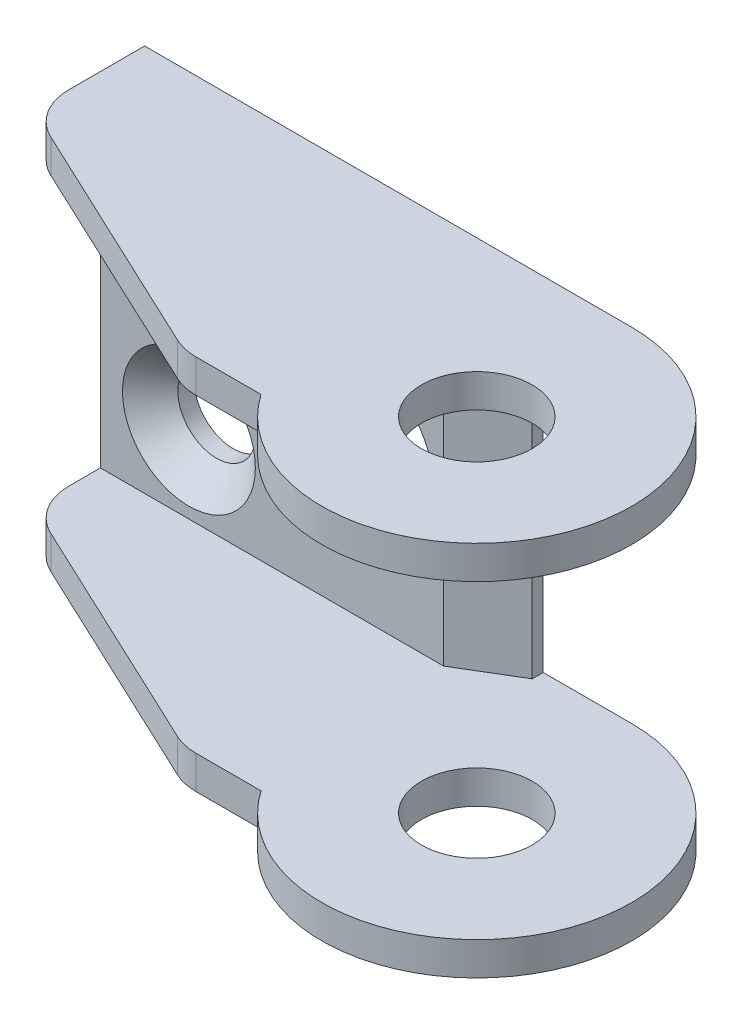
ISO-10303-21;
HEADER;
FILE_DESCRIPTION(('STEP AP214'),'2;1');
FILE_NAME('part.step','',(''),(''),'','','');
FILE_SCHEMA(('AUTOMOTIVE_DESIGN { 1 0 10303 214 1 1 1 1 }'));
ENDSEC;
DATA;
#1=APPLICATION_CONTEXT('core data for automotive mechanical design processes');
#2=APPLICATION_PROTOCOL_DEFINITION('international standard','automotive_design',2000,#1);
#3=PRODUCT_CONTEXT('',#1,'mechanical');
#4=PRODUCT('Part','Part','',(#3));
#5=PRODUCT_RELATED_PRODUCT_CATEGORY('part','',(#4));
#6=PRODUCT_DEFINITION_FORMATION('','',#4);
#7=PRODUCT_DEFINITION_CONTEXT('part definition',#1,'design');
#8=PRODUCT_DEFINITION('design','',#6,#7);
#9=PRODUCT_DEFINITION_SHAPE('','',#8);
#10=(LENGTH_UNIT() NAMED_UNIT(*) SI_UNIT(.MILLI.,.METRE.));
#11=(NAMED_UNIT(*) PLANE_ANGLE_UNIT() SI_UNIT($,.RADIAN.));
#12=(NAMED_UNIT(*) SI_UNIT($,.STERADIAN.) SOLID_ANGLE_UNIT());
#13=UNCERTAINTY_MEASURE_WITH_UNIT(LENGTH_MEASURE(1.E-05),#10,'distance_accuracy_value','');
#14=(GEOMETRIC_REPRESENTATION_CONTEXT(3) GLOBAL_UNCERTAINTY_ASSIGNED_CONTEXT((#13)) GLOBAL_UNIT_ASSIGNED_CONTEXT((#10,
#11,#12)) REPRESENTATION_CONTEXT('',''));
#15=CARTESIAN_POINT('',(0.,0.,0.));
#16=DIRECTION('',(0.,0.,1.));
#17=DIRECTION('',(1.,0.,0.));
#18=AXIS2_PLACEMENT_3D('',#15,#16,#17);
#19=CARTESIAN_POINT('',(-19.5,17.,-3.58680185867504));
#20=DIRECTION('',(0.,1.,0.));
#21=DIRECTION('',(0.,0.,1.));
#22=AXIS2_PLACEMENT_3D('',#19,#20,#21);
#23=CYLINDRICAL_SURFACE('',#22,2.49999999999998);
#24=CARTESIAN_POINT('',(-19.5,15.5,-3.58680185867504));
#25=DIRECTION('',(0.,1.,0.));
#26=DIRECTION('',(0.,0.,1.));
#27=AXIS2_PLACEMENT_3D('',#24,#25,#26);
#28=CIRCLE('',#27,2.49999999999998);
#29=CARTESIAN_POINT('',(-22.,15.5,-3.58680185867504));
#30=VERTEX_POINT('',#29);
#31=CARTESIAN_POINT('',(-20.5641210484647,15.5,-1.32458029697639));
#32=VERTEX_POINT('',#31);
#33=EDGE_CURVE('E252',#30,#32,#28,.T.);
#34=ORIENTED_EDGE('',*,*,#33,.T.);
#35=DIRECTION('',(0.,1.,0.));
#36=VECTOR('',#35,1.);
#37=CARTESIAN_POINT('',(-20.5641210484647,17.,-1.32458029697639));
#38=LINE('',#37,#36);
#39=CARTESIAN_POINT('',(-20.5641210484647,17.,-1.32458029697639));
#40=VERTEX_POINT('',#39);
#41=EDGE_CURVE('E210',#32,#40,#38,.T.);
#42=ORIENTED_EDGE('',*,*,#41,.T.);
#43=CARTESIAN_POINT('',(-19.5,17.,-3.58680185867504));
#44=DIRECTION('',(0.,1.,0.));
#45=DIRECTION('',(0.,0.,1.));
#46=AXIS2_PLACEMENT_3D('',#43,#44,#45);
#47=CIRCLE('',#46,2.49999999999998);
#48=CARTESIAN_POINT('',(-22.,17.,-3.58680185867504));
#49=VERTEX_POINT('',#48);
#50=EDGE_CURVE('E257',#49,#40,#47,.T.);
#51=ORIENTED_EDGE('',*,*,#50,.F.);
#52=DIRECTION('',(0.,1.,0.));
#53=VECTOR('',#52,1.);
#54=CARTESIAN_POINT('',(-22.,0.,-3.58680185867505));
#55=LINE('',#54,#53);
#56=EDGE_CURVE('E127',#30,#49,#55,.T.);
#57=ORIENTED_EDGE('',*,*,#56,.F.);
#58=EDGE_LOOP('',(#34,#42,#51,#57));
#59=FACE_BOUND('',#58,.T.);
#60=ADVANCED_FACE('F17',(#59),#23,.T.);
#61=CARTESIAN_POINT('',(-20.5641210484647,17.,-1.32458029697639));
#62=DIRECTION('',(0.425648419385887,0.,-0.904888624679466));
#63=DIRECTION('',(-0.904888624679466,0.,-0.425648419385887));
#64=AXIS2_PLACEMENT_3D('',#61,#62,#63);
#65=PLANE('',#64);
#66=ORIENTED_EDGE('',*,*,#41,.F.);
#67=DIRECTION('',(0.904888624679466,0.,0.425648419385888));
#68=VECTOR('',#67,1.);
#69=CARTESIAN_POINT('',(-20.5641210484647,15.5,-1.32458029697639));
#70=LINE('',#69,#68);
#71=CARTESIAN_POINT('',(-9.75005730883081,15.5,3.76222156169866));
#72=VERTEX_POINT('',#71);
#73=EDGE_CURVE('E251',#32,#72,#70,.T.);
#74=ORIENTED_EDGE('',*,*,#73,.T.);
#75=DIRECTION('',(0.,1.,0.));
#76=VECTOR('',#75,1.);
#77=CARTESIAN_POINT('',(-9.75005730883081,17.,3.76222156169865));
#78=LINE('',#77,#76);
#79=CARTESIAN_POINT('',(-9.75005730883081,17.,3.76222156169866));
#80=VERTEX_POINT('',#79);
#81=EDGE_CURVE('E98',#80,#72,#78,.F.);
#82=ORIENTED_EDGE('',*,*,#81,.F.);
#83=DIRECTION('',(0.904888624679466,0.,0.425648419385888));
#84=VECTOR('',#83,1.);
#85=CARTESIAN_POINT('',(-20.5641210484647,17.,-1.32458029697639));
#86=LINE('',#85,#84);
#87=EDGE_CURVE('E126',#40,#80,#86,.T.);
#88=ORIENTED_EDGE('',*,*,#87,.F.);
#89=EDGE_LOOP('',(#66,#74,#82,#88));
#90=FACE_BOUND('',#89,.T.);
#91=ADVANCED_FACE('F331',(#90),#65,.F.);
#92=CARTESIAN_POINT('',(-8.68593626036609,17.,1.5));
#93=DIRECTION('',(0.,1.,0.));
#94=DIRECTION('',(0.,0.,1.));
#95=AXIS2_PLACEMENT_3D('',#92,#93,#94);
#96=CYLINDRICAL_SURFACE('',#95,2.49999999999999);
#97=CARTESIAN_POINT('',(-8.68593626036609,15.5,1.5));
#98=DIRECTION('',(0.,1.,0.));
#99=DIRECTION('',(0.,0.,1.));
#100=AXIS2_PLACEMENT_3D('',#97,#98,#99);
#101=CIRCLE('',#100,2.49999999999999);
#102=CARTESIAN_POINT('',(-8.68593626036609,15.5,3.99999999999999));
#103=VERTEX_POINT('',#102);
#104=EDGE_CURVE('E110',#72,#103,#101,.T.);
#105=ORIENTED_EDGE('',*,*,#104,.T.);
#106=DIRECTION('',(0.,1.,0.));
#107=VECTOR('',#106,1.);
#108=CARTESIAN_POINT('',(-8.6859362603661,17.,3.99999999999999));
#109=LINE('',#108,#107);
#110=CARTESIAN_POINT('',(-8.68593626036609,17.,3.99999999999999));
#111=VERTEX_POINT('',#110);
#112=EDGE_CURVE('E103',#103,#111,#109,.T.);
#113=ORIENTED_EDGE('',*,*,#112,.T.);
#114=CARTESIAN_POINT('',(-8.68593626036609,17.,1.5));
#115=DIRECTION('',(0.,1.,0.));
#116=DIRECTION('',(0.,0.,1.));
#117=AXIS2_PLACEMENT_3D('',#114,#115,#116);
#118=CIRCLE('',#117,2.49999999999999);
#119=EDGE_CURVE('E107',#80,#111,#118,.T.);
#120=ORIENTED_EDGE('',*,*,#119,.F.);
#121=ORIENTED_EDGE('',*,*,#81,.T.);
#122=EDGE_LOOP('',(#105,#113,#120,#121));
#123=FACE_BOUND('',#122,.T.);
#124=ADVANCED_FACE('F105',(#123),#96,.T.);
#125=CARTESIAN_POINT('',(-8.6859362603661,17.,3.99999999999999));
#126=DIRECTION('',(0.,0.,-1.));
#127=DIRECTION('',(-1.,0.,0.));
#128=AXIS2_PLACEMENT_3D('',#125,#126,#127);
#129=PLANE('',#128);
#130=ORIENTED_EDGE('',*,*,#112,.F.);
#131=DIRECTION('',(1.,0.,0.));
#132=VECTOR('',#131,1.);
#133=CARTESIAN_POINT('',(-7.5,15.5,3.99999999999999));
#134=LINE('',#133,#132);
#135=CARTESIAN_POINT('',(-5.74456264653803,15.5,3.99999999999999));
#136=VERTEX_POINT('',#135);
#137=EDGE_CURVE('E249',#103,#136,#134,.T.);
#138=ORIENTED_EDGE('',*,*,#137,.T.);
#139=DIRECTION('',(0.,1.,0.));
#140=VECTOR('',#139,1.);
#141=CARTESIAN_POINT('',(-5.74456264653803,17.,4.));
#142=LINE('',#141,#140);
#143=CARTESIAN_POINT('',(-5.74456264653803,17.,3.99999999999999));
#144=VERTEX_POINT('',#143);
#145=EDGE_CURVE('E113',#144,#136,#142,.F.);
#146=ORIENTED_EDGE('',*,*,#145,.F.);
#147=DIRECTION('',(1.,0.,0.));
#148=VECTOR('',#147,1.);
#149=CARTESIAN_POINT('',(-7.5,17.,3.99999999999999));
#150=LINE('',#149,#148);
#151=EDGE_CURVE('E116',#111,#144,#150,.T.);
#152=ORIENTED_EDGE('',*,*,#151,.F.);
#153=EDGE_LOOP('',(#130,#138,#146,#152));
#154=FACE_BOUND('',#153,.T.);
#155=ADVANCED_FACE('F117',(#154),#129,.F.);
#156=CARTESIAN_POINT('',(0.,17.,0.));
#157=DIRECTION('',(0.,1.,0.));
#158=DIRECTION('',(0.,0.,1.));
#159=AXIS2_PLACEMENT_3D('',#156,#157,#158);
#160=CYLINDRICAL_SURFACE('',#159,7.);
#161=CARTESIAN_POINT('',(0.,15.5,0.));
#162=DIRECTION('',(0.,1.,0.));
#163=DIRECTION('',(0.,0.,1.));
#164=AXIS2_PLACEMENT_3D('',#161,#162,#163);
#165=CIRCLE('',#164,7.);
#166=CARTESIAN_POINT('',(0.,15.5,-7.));
#167=VERTEX_POINT('',#166);
#168=EDGE_CURVE('E199',#136,#167,#165,.T.);
#169=ORIENTED_EDGE('',*,*,#168,.T.);
#170=DIRECTION('',(0.,1.,0.));
#171=VECTOR('',#170,1.);
#172=CARTESIAN_POINT('',(0.,17.,-7.));
#173=LINE('',#172,#171);
#174=CARTESIAN_POINT('',(0.,17.,-7.));
#175=VERTEX_POINT('',#174);
#176=EDGE_CURVE('E192',#167,#175,#173,.T.);
#177=ORIENTED_EDGE('',*,*,#176,.T.);
#178=CARTESIAN_POINT('',(0.,17.,0.));
#179=DIRECTION('',(0.,1.,0.));
#180=DIRECTION('',(0.,0.,1.));
#181=AXIS2_PLACEMENT_3D('',#178,#179,#180);
#182=CIRCLE('',#181,7.);
#183=EDGE_CURVE('E122',#144,#175,#182,.T.);
#184=ORIENTED_EDGE('',*,*,#183,.F.);
#185=ORIENTED_EDGE('',*,*,#145,.T.);
#186=EDGE_LOOP('',(#169,#177,#184,#185));
#187=FACE_BOUND('',#186,.T.);
#188=ADVANCED_FACE('F335',(#187),#160,.T.);
#189=CARTESIAN_POINT('',(0.,17.,0.));
#190=DIRECTION('',(0.,1.,0.));
#191=DIRECTION('',(0.,0.,1.));
#192=AXIS2_PLACEMENT_3D('',#189,#190,#191);
#193=CYLINDRICAL_SURFACE('',#192,2.5);
#194=CARTESIAN_POINT('',(0.,17.,0.));
#195=DIRECTION('',(0.,1.,0.));
#196=DIRECTION('',(0.,0.,1.));
#197=AXIS2_PLACEMENT_3D('',#194,#195,#196);
#198=CIRCLE('',#197,2.5);
#199=CARTESIAN_POINT('',(0.,17.,2.5));
#200=VERTEX_POINT('',#199);
#201=EDGE_CURVE('E255',#200,#200,#198,.F.);
#202=ORIENTED_EDGE('',*,*,#201,.F.);
#203=EDGE_LOOP('',(#202));
#204=FACE_BOUND('',#203,.T.);
#205=CARTESIAN_POINT('',(0.,15.5,0.));
#206=DIRECTION('',(0.,1.,0.));
#207=DIRECTION('',(0.,0.,1.));
#208=AXIS2_PLACEMENT_3D('',#205,#206,#207);
#209=CIRCLE('',#208,2.5);
#210=CARTESIAN_POINT('',(0.,15.5,2.5));
#211=VERTEX_POINT('',#210);
#212=EDGE_CURVE('E204',#211,#211,#209,.F.);
#213=ORIENTED_EDGE('',*,*,#212,.T.);
#214=EDGE_LOOP('',(#213));
#215=FACE_BOUND('',#214,.T.);
#216=ADVANCED_FACE('F602',(#204,#215),#193,.F.);
#217=CARTESIAN_POINT('',(-22.,1.5,-5.00000000000001));
#218=DIRECTION('',(0.,0.,1.));
#219=DIRECTION('',(1.,0.,0.));
#220=AXIS2_PLACEMENT_3D('',#217,#218,#219);
#221=PLANE('',#220);
#222=CARTESIAN_POINT('',(-18.,5.,-5.00000000002455));
#223=DIRECTION('',(0.,0.,1.));
#224=DIRECTION('',(1.,0.,0.));
#225=AXIS2_PLACEMENT_3D('',#222,#223,#224);
#226=CIRCLE('',#225,2.99999999992906);
#227=CARTESIAN_POINT('',(-15.0000000000709,5.,-5.00000000002455));
#228=VERTEX_POINT('',#227);
#229=EDGE_CURVE('E134',#228,#228,#226,.F.);
#230=ORIENTED_EDGE('',*,*,#229,.T.);
#231=EDGE_LOOP('',(#230));
#232=FACE_BOUND('',#231,.T.);
#233=CARTESIAN_POINT('',(-10.,8.5,-5.0000000000432));
#234=DIRECTION('',(0.,0.,1.));
#235=DIRECTION('',(1.,0.,0.));
#236=AXIS2_PLACEMENT_3D('',#233,#234,#235);
#237=CIRCLE('',#236,2.9999999999859);
#238=CARTESIAN_POINT('',(-7.0000000000141,8.5,-5.0000000000432));
#239=VERTEX_POINT('',#238);
#240=EDGE_CURVE('E20',#239,#239,#237,.F.);
#241=ORIENTED_EDGE('',*,*,#240,.T.);
#242=EDGE_LOOP('',(#241));
#243=FACE_BOUND('',#242,.T.);
#244=CARTESIAN_POINT('',(-18.,12.,-5.00000000002455));
#245=DIRECTION('',(0.,0.,1.));
#246=DIRECTION('',(1.,0.,0.));
#247=AXIS2_PLACEMENT_3D('',#244,#245,#246);
#248=CIRCLE('',#247,2.99999999992906);
#249=CARTESIAN_POINT('',(-15.0000000000709,12.,-5.00000000002455));
#250=VERTEX_POINT('',#249);
#251=EDGE_CURVE('E137',#250,#250,#248,.F.);
#252=ORIENTED_EDGE('',*,*,#251,.T.);
#253=EDGE_LOOP('',(#252));
#254=FACE_BOUND('',#253,.T.);
#255=DIRECTION('',(0.,1.,0.));
#256=VECTOR('',#255,1.);
#257=CARTESIAN_POINT('',(-6.5,1.5,-5.00000000000001));
#258=LINE('',#257,#256);
#259=CARTESIAN_POINT('',(-6.5,15.5,-5.00000000000001));
#260=VERTEX_POINT('',#259);
#261=CARTESIAN_POINT('',(-6.5,1.5,-5.00000000000001));
#262=VERTEX_POINT('',#261);
#263=EDGE_CURVE('E166',#260,#262,#258,.F.);
#264=ORIENTED_EDGE('',*,*,#263,.F.);
#265=DIRECTION('',(1.,0.,0.));
#266=VECTOR('',#265,1.);
#267=CARTESIAN_POINT('',(-7.5,15.5,-5.00000000000001));
#268=LINE('',#267,#266);
#269=CARTESIAN_POINT('',(-22.,15.5,-5.00000000000001));
#270=VERTEX_POINT('',#269);
#271=EDGE_CURVE('E198',#260,#270,#268,.F.);
#272=ORIENTED_EDGE('',*,*,#271,.T.);
#273=DIRECTION('',(0.,1.,0.));
#274=VECTOR('',#273,1.);
#275=CARTESIAN_POINT('',(-22.,0.,-5.00000000000001));
#276=LINE('',#275,#274);
#277=CARTESIAN_POINT('',(-22.,1.5,-5.00000000000001));
#278=VERTEX_POINT('',#277);
#279=EDGE_CURVE('E129',#278,#270,#276,.T.);
#280=ORIENTED_EDGE('',*,*,#279,.F.);
#281=DIRECTION('',(1.,0.,0.));
#282=VECTOR('',#281,1.);
#283=CARTESIAN_POINT('',(-7.5,1.5,-5.00000000000001));
#284=LINE('',#283,#282);
#285=EDGE_CURVE('E170',#262,#278,#284,.F.);
#286=ORIENTED_EDGE('',*,*,#285,.F.);
#287=EDGE_LOOP('',(#264,#272,#280,#286));
#288=FACE_BOUND('',#287,.T.);
#289=ADVANCED_FACE('F386',(#232,#243,#254,#288),#221,.T.);
#290=CARTESIAN_POINT('',(-6.5,1.5,-5.00000000000001));
#291=DIRECTION('',(0.514495755427527,0.,0.857492925712544));
#292=DIRECTION('',(0.857492925712544,0.,-0.514495755427527));
#293=AXIS2_PLACEMENT_3D('',#290,#291,#292);
#294=PLANE('',#293);
#295=DIRECTION('',(-0.857492925712544,0.,0.514495755427527));
#296=VECTOR('',#295,1.);
#297=CARTESIAN_POINT('',(-4.,15.5,-6.50000000000001));
#298=LINE('',#297,#296);
#299=CARTESIAN_POINT('',(-4.,15.5,-6.50000000000001));
#300=VERTEX_POINT('',#299);
#301=EDGE_CURVE('E195',#300,#260,#298,.T.);
#302=ORIENTED_EDGE('',*,*,#301,.T.);
#303=ORIENTED_EDGE('',*,*,#263,.T.);
#304=DIRECTION('',(-0.857492925712544,0.,0.514495755427527));
#305=VECTOR('',#304,1.);
#306=CARTESIAN_POINT('',(-4.,1.5,-6.50000000000001));
#307=LINE('',#306,#305);
#308=CARTESIAN_POINT('',(-4.,1.5,-6.50000000000001));
#309=VERTEX_POINT('',#308);
#310=EDGE_CURVE('E174',#309,#262,#307,.T.);
#311=ORIENTED_EDGE('',*,*,#310,.F.);
#312=DIRECTION('',(0.,1.,0.));
#313=VECTOR('',#312,1.);
#314=CARTESIAN_POINT('',(-4.,1.5,-6.50000000000001));
#315=LINE('',#314,#313);
#316=EDGE_CURVE('E167',#300,#309,#315,.F.);
#317=ORIENTED_EDGE('',*,*,#316,.F.);
#318=EDGE_LOOP('',(#302,#303,#311,#317));
#319=FACE_BOUND('',#318,.T.);
#320=ADVANCED_FACE('F388',(#319),#294,.T.);
#321=CARTESIAN_POINT('',(-8.6859362603661,0.,3.99999999999999));
#322=DIRECTION('',(0.,0.,1.));
#323=DIRECTION('',(1.,0.,0.));
#324=AXIS2_PLACEMENT_3D('',#321,#322,#323);
#325=PLANE('',#324);
#326=DIRECTION('',(1.,0.,0.));
#327=VECTOR('',#326,1.);
#328=CARTESIAN_POINT('',(-7.5,1.5,3.99999999999999));
#329=LINE('',#328,#327);
#330=CARTESIAN_POINT('',(-8.68593626036609,1.5,3.99999999999999));
#331=VERTEX_POINT('',#330);
#332=CARTESIAN_POINT('',(-5.74456264653803,1.5,3.99999999999999));
#333=VERTEX_POINT('',#332);
#334=EDGE_CURVE('E237',#331,#333,#329,.T.);
#335=ORIENTED_EDGE('',*,*,#334,.F.);
#336=DIRECTION('',(0.,1.,0.));
#337=VECTOR('',#336,1.);
#338=CARTESIAN_POINT('',(-8.68593626036609,0.,3.99999999999999));
#339=LINE('',#338,#337);
#340=CARTESIAN_POINT('',(-8.68593626036609,0.,3.99999999999999));
#341=VERTEX_POINT('',#340);
#342=EDGE_CURVE('E146',#341,#331,#339,.T.);
#343=ORIENTED_EDGE('',*,*,#342,.F.);
#344=DIRECTION('',(1.,0.,0.));
#345=VECTOR('',#344,1.);
#346=CARTESIAN_POINT('',(-7.5,0.,3.99999999999999));
#347=LINE('',#346,#345);
#348=CARTESIAN_POINT('',(-5.74456264653803,0.,3.99999999999999));
#349=VERTEX_POINT('',#348);
#350=EDGE_CURVE('E231',#341,#349,#347,.T.);
#351=ORIENTED_EDGE('',*,*,#350,.T.);
#352=DIRECTION('',(0.,1.,0.));
#353=VECTOR('',#352,1.);
#354=CARTESIAN_POINT('',(-5.74456264653803,0.,4.));
#355=LINE('',#354,#353);
#356=EDGE_CURVE('E161',#333,#349,#355,.F.);
#357=ORIENTED_EDGE('',*,*,#356,.F.);
#358=EDGE_LOOP('',(#335,#343,#351,#357));
#359=FACE_BOUND('',#358,.T.);
#360=ADVANCED_FACE('F403',(#359),#325,.T.);
#361=CARTESIAN_POINT('',(0.,0.,0.));
#362=DIRECTION('',(0.,1.,0.));
#363=DIRECTION('',(0.,0.,1.));
#364=AXIS2_PLACEMENT_3D('',#361,#362,#363);
#365=CYLINDRICAL_SURFACE('',#364,7.);
#366=CARTESIAN_POINT('',(0.,1.5,0.));
#367=DIRECTION('',(0.,1.,0.));
#368=DIRECTION('',(0.,0.,1.));
#369=AXIS2_PLACEMENT_3D('',#366,#367,#368);
#370=CIRCLE('',#369,7.);
#371=CARTESIAN_POINT('',(0.,1.5,-7.));
#372=VERTEX_POINT('',#371);
#373=EDGE_CURVE('E234',#333,#372,#370,.T.);
#374=ORIENTED_EDGE('',*,*,#373,.F.);
#375=ORIENTED_EDGE('',*,*,#356,.T.);
#376=CARTESIAN_POINT('',(0.,0.,0.));
#377=DIRECTION('',(0.,1.,0.));
#378=DIRECTION('',(0.,0.,1.));
#379=AXIS2_PLACEMENT_3D('',#376,#377,#378);
#380=CIRCLE('',#379,7.);
#381=CARTESIAN_POINT('',(0.,0.,-7.));
#382=VERTEX_POINT('',#381);
#383=EDGE_CURVE('E229',#349,#382,#380,.T.);
#384=ORIENTED_EDGE('',*,*,#383,.T.);
#385=DIRECTION('',(0.,1.,0.));
#386=VECTOR('',#385,1.);
#387=CARTESIAN_POINT('',(0.,0.,-7.));
#388=LINE('',#387,#386);
#389=EDGE_CURVE('E35',#382,#372,#388,.T.);
#390=ORIENTED_EDGE('',*,*,#389,.T.);
#391=EDGE_LOOP('',(#374,#375,#384,#390));
#392=FACE_BOUND('',#391,.T.);
#393=ADVANCED_FACE('F401',(#392),#365,.T.);
#394=CARTESIAN_POINT('',(-19.5,0.,-3.58680185867504));
#395=DIRECTION('',(0.,1.,0.));
#396=DIRECTION('',(0.,0.,1.));
#397=AXIS2_PLACEMENT_3D('',#394,#395,#396);
#398=CYLINDRICAL_SURFACE('',#397,2.49999999999998);
#399=CARTESIAN_POINT('',(-19.5,1.5,-3.58680185867504));
#400=DIRECTION('',(0.,1.,0.));
#401=DIRECTION('',(0.,0.,1.));
#402=AXIS2_PLACEMENT_3D('',#399,#400,#401);
#403=CIRCLE('',#402,2.49999999999998);
#404=CARTESIAN_POINT('',(-22.,1.5,-3.58680185867504));
#405=VERTEX_POINT('',#404);
#406=CARTESIAN_POINT('',(-20.5641210484647,1.5,-1.32458029697639));
#407=VERTEX_POINT('',#406);
#408=EDGE_CURVE('E242',#405,#407,#403,.T.);
#409=ORIENTED_EDGE('',*,*,#408,.F.);
#410=DIRECTION('',(0.,1.,0.));
#411=VECTOR('',#410,1.);
#412=CARTESIAN_POINT('',(-22.,0.,-3.58680185867505));
#413=LINE('',#412,#411);
#414=CARTESIAN_POINT('',(-22.,0.,-3.58680185867504));
#415=VERTEX_POINT('',#414);
#416=EDGE_CURVE('E136',#415,#405,#413,.T.);
#417=ORIENTED_EDGE('',*,*,#416,.F.);
#418=CARTESIAN_POINT('',(-19.5,0.,-3.58680185867504));
#419=DIRECTION('',(0.,1.,0.));
#420=DIRECTION('',(0.,0.,1.));
#421=AXIS2_PLACEMENT_3D('',#418,#419,#420);
#422=CIRCLE('',#421,2.49999999999998);
#423=CARTESIAN_POINT('',(-20.5641210484647,0.,-1.32458029697639));
#424=VERTEX_POINT('',#423);
#425=EDGE_CURVE('E225',#415,#424,#422,.T.);
#426=ORIENTED_EDGE('',*,*,#425,.T.);
#427=DIRECTION('',(0.,1.,0.));
#428=VECTOR('',#427,1.);
#429=CARTESIAN_POINT('',(-20.5641210484647,0.,-1.32458029697639));
#430=LINE('',#429,#428);
#431=EDGE_CURVE('E153',#407,#424,#430,.F.);
#432=ORIENTED_EDGE('',*,*,#431,.F.);
#433=EDGE_LOOP('',(#409,#417,#426,#432));
#434=FACE_BOUND('',#433,.T.);
#435=ADVANCED_FACE('F361',(#434),#398,.T.);
#436=CARTESIAN_POINT('',(-20.5641210484647,0.,-1.32458029697639));
#437=DIRECTION('',(-0.425648419385887,0.,0.904888624679466));
#438=DIRECTION('',(0.904888624679466,0.,0.425648419385887));
#439=AXIS2_PLACEMENT_3D('',#436,#437,#438);
#440=PLANE('',#439);
#441=DIRECTION('',(0.904888624679466,0.,0.425648419385888));
#442=VECTOR('',#441,1.);
#443=CARTESIAN_POINT('',(-20.5641210484647,1.5,-1.32458029697639));
#444=LINE('',#443,#442);
#445=CARTESIAN_POINT('',(-9.75005730883081,1.5,3.76222156169866));
#446=VERTEX_POINT('',#445);
#447=EDGE_CURVE('E241',#407,#446,#444,.T.);
#448=ORIENTED_EDGE('',*,*,#447,.F.);
#449=ORIENTED_EDGE('',*,*,#431,.T.);
#450=DIRECTION('',(0.904888624679466,0.,0.425648419385888));
#451=VECTOR('',#450,1.);
#452=CARTESIAN_POINT('',(-20.5641210484647,0.,-1.32458029697639));
#453=LINE('',#452,#451);
#454=CARTESIAN_POINT('',(-9.75005730883081,0.,3.76222156169866));
#455=VERTEX_POINT('',#454);
#456=EDGE_CURVE('E224',#424,#455,#453,.T.);
#457=ORIENTED_EDGE('',*,*,#456,.T.);
#458=DIRECTION('',(0.,1.,0.));
#459=VECTOR('',#458,1.);
#460=CARTESIAN_POINT('',(-9.75005730883081,0.,3.76222156169865));
#461=LINE('',#460,#459);
#462=EDGE_CURVE('E142',#446,#455,#461,.F.);
#463=ORIENTED_EDGE('',*,*,#462,.F.);
#464=EDGE_LOOP('',(#448,#449,#457,#463));
#465=FACE_BOUND('',#464,.T.);
#466=ADVANCED_FACE('F368',(#465),#440,.T.);
#467=CARTESIAN_POINT('',(-8.68593626036609,0.,1.5));
#468=DIRECTION('',(0.,1.,0.));
#469=DIRECTION('',(0.,0.,1.));
#470=AXIS2_PLACEMENT_3D('',#467,#468,#469);
#471=CYLINDRICAL_SURFACE('',#470,2.49999999999999);
#472=CARTESIAN_POINT('',(-8.68593626036609,1.5,1.5));
#473=DIRECTION('',(0.,1.,0.));
#474=DIRECTION('',(0.,0.,1.));
#475=AXIS2_PLACEMENT_3D('',#472,#473,#474);
#476=CIRCLE('',#475,2.49999999999999);
#477=EDGE_CURVE('E238',#446,#331,#476,.T.);
#478=ORIENTED_EDGE('',*,*,#477,.F.);
#479=ORIENTED_EDGE('',*,*,#462,.T.);
#480=CARTESIAN_POINT('',(-8.68593626036609,0.,1.5));
#481=DIRECTION('',(0.,1.,0.));
#482=DIRECTION('',(0.,0.,1.));
#483=AXIS2_PLACEMENT_3D('',#480,#481,#482);
#484=CIRCLE('',#483,2.49999999999999);
#485=EDGE_CURVE('E222',#455,#341,#484,.T.);
#486=ORIENTED_EDGE('',*,*,#485,.T.);
#487=ORIENTED_EDGE('',*,*,#342,.T.);
#488=EDGE_LOOP('',(#478,#479,#486,#487));
#489=FACE_BOUND('',#488,.T.);
#490=ADVANCED_FACE('F404',(#489),#471,.T.);
#491=CARTESIAN_POINT('',(0.,0.,0.));
#492=DIRECTION('',(0.,1.,0.));
#493=DIRECTION('',(0.,0.,1.));
#494=AXIS2_PLACEMENT_3D('',#491,#492,#493);
#495=CYLINDRICAL_SURFACE('',#494,2.5);
#496=CARTESIAN_POINT('',(0.,0.,0.));
#497=DIRECTION('',(0.,1.,0.));
#498=DIRECTION('',(0.,0.,1.));
#499=AXIS2_PLACEMENT_3D('',#496,#497,#498);
#500=CIRCLE('',#499,2.5);
#501=CARTESIAN_POINT('',(0.,0.,2.5));
#502=VERTEX_POINT('',#501);
#503=EDGE_CURVE('E218',#502,#502,#500,.F.);
#504=ORIENTED_EDGE('',*,*,#503,.T.);
#505=EDGE_LOOP('',(#504));
#506=FACE_BOUND('',#505,.T.);
#507=CARTESIAN_POINT('',(0.,1.5,0.));
#508=DIRECTION('',(0.,1.,0.));
#509=DIRECTION('',(0.,0.,1.));
#510=AXIS2_PLACEMENT_3D('',#507,#508,#509);
#511=CIRCLE('',#510,2.5);
#512=CARTESIAN_POINT('',(0.,1.5,2.5));
#513=VERTEX_POINT('',#512);
#514=EDGE_CURVE('E177',#513,#513,#511,.F.);
#515=ORIENTED_EDGE('',*,*,#514,.F.);
#516=EDGE_LOOP('',(#515));
#517=FACE_BOUND('',#516,.T.);
#518=ADVANCED_FACE('F406',(#506,#517),#495,.F.);
#519=CARTESIAN_POINT('',(-10.,8.5,-5.00000000010914));
#520=DIRECTION('',(0.,0.,1.));
#521=DIRECTION('',(1.,0.,0.));
#522=AXIS2_PLACEMENT_3D('',#519,#520,#521);
#523=CONICAL_SURFACE('',#522,2.99999999991996,0.785398163420186);
#524=CARTESIAN_POINT('',(-10.,8.5,-6.25000000000001));
#525=DIRECTION('',(0.,0.,-1.));
#526=DIRECTION('',(-1.,0.,0.));
#527=AXIS2_PLACEMENT_3D('',#524,#525,#526);
#528=CIRCLE('',#527,1.75);
#529=CARTESIAN_POINT('',(-11.75,8.5,-6.25000000000001));
#530=VERTEX_POINT('',#529);
#531=EDGE_CURVE('E221',#530,#530,#528,.T.);
#532=ORIENTED_EDGE('',*,*,#531,.T.);
#533=EDGE_LOOP('',(#532));
#534=FACE_BOUND('',#533,.T.);
#535=ORIENTED_EDGE('',*,*,#240,.F.);
#536=EDGE_LOOP('',(#535));
#537=FACE_BOUND('',#536,.T.);
#538=ADVANCED_FACE('F413',(#534,#537),#523,.F.);
#539=CARTESIAN_POINT('',(-18.,12.,-4.99999999999545));
#540=DIRECTION('',(0.,0.,1.));
#541=DIRECTION('',(1.,0.,0.));
#542=AXIS2_PLACEMENT_3D('',#539,#540,#541);
#543=CONICAL_SURFACE('',#542,2.99999999995816,0.785398163397448);
#544=CARTESIAN_POINT('',(-18.,12.,-6.25000000000001));
#545=DIRECTION('',(0.,0.,1.));
#546=DIRECTION('',(1.,0.,0.));
#547=AXIS2_PLACEMENT_3D('',#544,#545,#546);
#548=CIRCLE('',#547,1.75);
#549=CARTESIAN_POINT('',(-16.25,12.,-6.25000000000001));
#550=VERTEX_POINT('',#549);
#551=EDGE_CURVE('E280',#550,#550,#548,.F.);
#552=ORIENTED_EDGE('',*,*,#551,.T.);
#553=EDGE_LOOP('',(#552));
#554=FACE_BOUND('',#553,.T.);
#555=ORIENTED_EDGE('',*,*,#251,.F.);
#556=EDGE_LOOP('',(#555));
#557=FACE_BOUND('',#556,.T.);
#558=ADVANCED_FACE('F455',(#554,#557),#543,.F.);
#559=CARTESIAN_POINT('',(-18.,5.,-4.99999999999545));
#560=DIRECTION('',(0.,0.,1.));
#561=DIRECTION('',(1.,0.,0.));
#562=AXIS2_PLACEMENT_3D('',#559,#560,#561);
#563=CONICAL_SURFACE('',#562,2.99999999995816,0.785398163397448);
#564=CARTESIAN_POINT('',(-18.,5.,-6.25000000000001));
#565=DIRECTION('',(0.,0.,-1.));
#566=DIRECTION('',(-1.,0.,0.));
#567=AXIS2_PLACEMENT_3D('',#564,#565,#566);
#568=CIRCLE('',#567,1.75);
#569=CARTESIAN_POINT('',(-19.75,5.,-6.25000000000001));
#570=VERTEX_POINT('',#569);
#571=EDGE_CURVE('E276',#570,#570,#568,.T.);
#572=ORIENTED_EDGE('',*,*,#571,.T.);
#573=EDGE_LOOP('',(#572));
#574=FACE_BOUND('',#573,.T.);
#575=ORIENTED_EDGE('',*,*,#229,.F.);
#576=EDGE_LOOP('',(#575));
#577=FACE_BOUND('',#576,.T.);
#578=ADVANCED_FACE('F452',(#574,#577),#563,.F.);
#579=CARTESIAN_POINT('',(-22.,0.,-7.00000000000001));
#580=DIRECTION('',(-1.,0.,0.));
#581=DIRECTION('',(0.,0.,1.));
#582=AXIS2_PLACEMENT_3D('',#579,#580,#581);
#583=PLANE('',#582);
#584=DIRECTION('',(0.,0.,1.));
#585=VECTOR('',#584,1.);
#586=CARTESIAN_POINT('',(-22.,17.,0.));
#587=LINE('',#586,#585);
#588=CARTESIAN_POINT('',(-22.,17.,-7.00000000000001));
#589=VERTEX_POINT('',#588);
#590=EDGE_CURVE('E258',#589,#49,#587,.T.);
#591=ORIENTED_EDGE('',*,*,#590,.F.);
#592=DIRECTION('',(0.,1.,0.));
#593=VECTOR('',#592,1.);
#594=CARTESIAN_POINT('',(-22.,0.,-7.00000000000001));
#595=LINE('',#594,#593);
#596=CARTESIAN_POINT('',(-22.,0.,-7.00000000000001));
#597=VERTEX_POINT('',#596);
#598=EDGE_CURVE('E271',#597,#589,#595,.T.);
#599=ORIENTED_EDGE('',*,*,#598,.F.);
#600=DIRECTION('',(0.,0.,1.));
#601=VECTOR('',#600,1.);
#602=CARTESIAN_POINT('',(-22.,0.,0.));
#603=LINE('',#602,#601);
#604=EDGE_CURVE('E228',#597,#415,#603,.T.);
#605=ORIENTED_EDGE('',*,*,#604,.T.);
#606=ORIENTED_EDGE('',*,*,#416,.T.);
#607=DIRECTION('',(0.,0.,1.));
#608=VECTOR('',#607,1.);
#609=CARTESIAN_POINT('',(-22.,1.5,0.));
#610=LINE('',#609,#608);
#611=EDGE_CURVE('E187',#278,#405,#610,.T.);
#612=ORIENTED_EDGE('',*,*,#611,.F.);
#613=ORIENTED_EDGE('',*,*,#279,.T.);
#614=DIRECTION('',(0.,0.,1.));
#615=VECTOR('',#614,1.);
#616=CARTESIAN_POINT('',(-22.,15.5,0.));
#617=LINE('',#616,#615);
#618=EDGE_CURVE('E254',#270,#30,#617,.T.);
#619=ORIENTED_EDGE('',*,*,#618,.T.);
#620=ORIENTED_EDGE('',*,*,#56,.T.);
#621=EDGE_LOOP('',(#591,#599,#605,#606,#612,#613,#619,#620));
#622=FACE_BOUND('',#621,.T.);
#623=ADVANCED_FACE('F321',(#622),#583,.T.);
#624=CARTESIAN_POINT('',(-7.5,17.,0.));
#625=DIRECTION('',(0.,1.,0.));
#626=DIRECTION('',(0.,0.,1.));
#627=AXIS2_PLACEMENT_3D('',#624,#625,#626);
#628=PLANE('',#627);
#629=ORIENTED_EDGE('',*,*,#201,.T.);
#630=EDGE_LOOP('',(#629));
#631=FACE_BOUND('',#630,.T.);
#632=ORIENTED_EDGE('',*,*,#50,.T.);
#633=ORIENTED_EDGE('',*,*,#87,.T.);
#634=ORIENTED_EDGE('',*,*,#119,.T.);
#635=ORIENTED_EDGE('',*,*,#151,.T.);
#636=ORIENTED_EDGE('',*,*,#183,.T.);
#637=DIRECTION('',(-1.,0.,0.));
#638=VECTOR('',#637,1.);
#639=CARTESIAN_POINT('',(0.,17.,-7.));
#640=LINE('',#639,#638);
#641=EDGE_CURVE('E268',#589,#175,#640,.F.);
#642=ORIENTED_EDGE('',*,*,#641,.F.);
#643=ORIENTED_EDGE('',*,*,#590,.T.);
#644=EDGE_LOOP('',(#632,#633,#634,#635,#636,#642,#643));
#645=FACE_BOUND('',#644,.T.);
#646=ADVANCED_FACE('F125',(#631,#645),#628,.T.);
#647=CARTESIAN_POINT('',(-7.5,15.5,0.));
#648=DIRECTION('',(0.,1.,0.));
#649=DIRECTION('',(0.,0.,1.));
#650=AXIS2_PLACEMENT_3D('',#647,#648,#649);
#651=PLANE('',#650);
#652=ORIENTED_EDGE('',*,*,#212,.F.);
#653=EDGE_LOOP('',(#652));
#654=FACE_BOUND('',#653,.T.);
#655=ORIENTED_EDGE('',*,*,#301,.F.);
#656=DIRECTION('',(0.,0.,-1.));
#657=VECTOR('',#656,1.);
#658=CARTESIAN_POINT('',(-4.,15.5,-6.50000000000001));
#659=LINE('',#658,#657);
#660=CARTESIAN_POINT('',(-4.,15.5,-7.));
#661=VERTEX_POINT('',#660);
#662=EDGE_CURVE('E171',#661,#300,#659,.F.);
#663=ORIENTED_EDGE('',*,*,#662,.F.);
#664=DIRECTION('',(-1.,0.,0.));
#665=VECTOR('',#664,1.);
#666=CARTESIAN_POINT('',(0.,15.5,-7.));
#667=LINE('',#666,#665);
#668=EDGE_CURVE('E270',#167,#661,#667,.T.);
#669=ORIENTED_EDGE('',*,*,#668,.F.);
#670=ORIENTED_EDGE('',*,*,#168,.F.);
#671=ORIENTED_EDGE('',*,*,#137,.F.);
#672=ORIENTED_EDGE('',*,*,#104,.F.);
#673=ORIENTED_EDGE('',*,*,#73,.F.);
#674=ORIENTED_EDGE('',*,*,#33,.F.);
#675=ORIENTED_EDGE('',*,*,#618,.F.);
#676=ORIENTED_EDGE('',*,*,#271,.F.);
#677=EDGE_LOOP('',(#655,#663,#669,#670,#671,#672,#673,#674,#675,#676));
#678=FACE_BOUND('',#677,.T.);
#679=ADVANCED_FACE('F328',(#654,#678),#651,.F.);
#680=CARTESIAN_POINT('',(-4.,1.5,-6.50000000000001));
#681=DIRECTION('',(1.,0.,0.));
#682=DIRECTION('',(0.,0.,-1.));
#683=AXIS2_PLACEMENT_3D('',#680,#681,#682);
#684=PLANE('',#683);
#685=ORIENTED_EDGE('',*,*,#662,.T.);
#686=ORIENTED_EDGE('',*,*,#316,.T.);
#687=DIRECTION('',(0.,0.,1.));
#688=VECTOR('',#687,1.);
#689=CARTESIAN_POINT('',(-4.,1.5,0.));
#690=LINE('',#689,#688);
#691=CARTESIAN_POINT('',(-4.,1.5,-7.));
#692=VERTEX_POINT('',#691);
#693=EDGE_CURVE('E178',#692,#309,#690,.T.);
#694=ORIENTED_EDGE('',*,*,#693,.F.);
#695=DIRECTION('',(0.,1.,0.));
#696=VECTOR('',#695,1.);
#697=CARTESIAN_POINT('',(-4.,0.,-7.));
#698=LINE('',#697,#696);
#699=EDGE_CURVE('E274',#661,#692,#698,.F.);
#700=ORIENTED_EDGE('',*,*,#699,.F.);
#701=EDGE_LOOP('',(#685,#686,#694,#700));
#702=FACE_BOUND('',#701,.T.);
#703=ADVANCED_FACE('F394',(#702),#684,.T.);
#704=CARTESIAN_POINT('',(-7.5,1.5,0.));
#705=DIRECTION('',(0.,1.,0.));
#706=DIRECTION('',(0.,0.,1.));
#707=AXIS2_PLACEMENT_3D('',#704,#705,#706);
#708=PLANE('',#707);
#709=ORIENTED_EDGE('',*,*,#514,.T.);
#710=EDGE_LOOP('',(#709));
#711=FACE_BOUND('',#710,.T.);
#712=ORIENTED_EDGE('',*,*,#693,.T.);
#713=ORIENTED_EDGE('',*,*,#310,.T.);
#714=ORIENTED_EDGE('',*,*,#285,.T.);
#715=ORIENTED_EDGE('',*,*,#611,.T.);
#716=ORIENTED_EDGE('',*,*,#408,.T.);
#717=ORIENTED_EDGE('',*,*,#447,.T.);
#718=ORIENTED_EDGE('',*,*,#477,.T.);
#719=ORIENTED_EDGE('',*,*,#334,.T.);
#720=ORIENTED_EDGE('',*,*,#373,.T.);
#721=DIRECTION('',(-1.,0.,0.));
#722=VECTOR('',#721,1.);
#723=CARTESIAN_POINT('',(0.,1.5,-7.));
#724=LINE('',#723,#722);
#725=EDGE_CURVE('E296',#692,#372,#724,.F.);
#726=ORIENTED_EDGE('',*,*,#725,.F.);
#727=EDGE_LOOP('',(#712,#713,#714,#715,#716,#717,#718,#719,#720,#726));
#728=FACE_BOUND('',#727,.T.);
#729=ADVANCED_FACE('F383',(#711,#728),#708,.T.);
#730=CARTESIAN_POINT('',(-7.5,0.,0.));
#731=DIRECTION('',(0.,1.,0.));
#732=DIRECTION('',(0.,0.,1.));
#733=AXIS2_PLACEMENT_3D('',#730,#731,#732);
#734=PLANE('',#733);
#735=ORIENTED_EDGE('',*,*,#503,.F.);
#736=EDGE_LOOP('',(#735));
#737=FACE_BOUND('',#736,.T.);
#738=ORIENTED_EDGE('',*,*,#456,.F.);
#739=ORIENTED_EDGE('',*,*,#425,.F.);
#740=ORIENTED_EDGE('',*,*,#604,.F.);
#741=DIRECTION('',(-1.,0.,0.));
#742=VECTOR('',#741,1.);
#743=CARTESIAN_POINT('',(0.,0.,-7.));
#744=LINE('',#743,#742);
#745=EDGE_CURVE('E217',#382,#597,#744,.T.);
#746=ORIENTED_EDGE('',*,*,#745,.F.);
#747=ORIENTED_EDGE('',*,*,#383,.F.);
#748=ORIENTED_EDGE('',*,*,#350,.F.);
#749=ORIENTED_EDGE('',*,*,#485,.F.);
#750=EDGE_LOOP('',(#738,#739,#740,#746,#747,#748,#749));
#751=FACE_BOUND('',#750,.T.);
#752=ADVANCED_FACE('F369',(#737,#751),#734,.F.);
#753=CARTESIAN_POINT('',(-10.,8.5,-5.00000000000001));
#754=DIRECTION('',(0.,0.,-1.));
#755=DIRECTION('',(-1.,0.,0.));
#756=AXIS2_PLACEMENT_3D('',#753,#754,#755);
#757=CYLINDRICAL_SURFACE('',#756,1.75);
#758=CARTESIAN_POINT('',(-10.,8.5,-7.));
#759=DIRECTION('',(0.,0.,-1.));
#760=DIRECTION('',(-1.,0.,0.));
#761=AXIS2_PLACEMENT_3D('',#758,#759,#760);
#762=CIRCLE('',#761,1.75);
#763=CARTESIAN_POINT('',(-11.75,8.5,-7.));
#764=VERTEX_POINT('',#763);
#765=EDGE_CURVE('E214',#764,#764,#762,.F.);
#766=ORIENTED_EDGE('',*,*,#765,.F.);
#767=EDGE_LOOP('',(#766));
#768=FACE_BOUND('',#767,.T.);
#769=ORIENTED_EDGE('',*,*,#531,.F.);
#770=EDGE_LOOP('',(#769));
#771=FACE_BOUND('',#770,.T.);
#772=ADVANCED_FACE('F431',(#768,#771),#757,.F.);
#773=CARTESIAN_POINT('',(-18.,12.,-5.00000000000001));
#774=DIRECTION('',(0.,0.,1.));
#775=DIRECTION('',(1.,0.,0.));
#776=AXIS2_PLACEMENT_3D('',#773,#774,#775);
#777=CYLINDRICAL_SURFACE('',#776,1.75);
#778=CARTESIAN_POINT('',(-18.,12.,-7.));
#779=DIRECTION('',(0.,0.,1.));
#780=DIRECTION('',(1.,0.,0.));
#781=AXIS2_PLACEMENT_3D('',#778,#779,#780);
#782=CIRCLE('',#781,1.75);
#783=CARTESIAN_POINT('',(-16.25,12.,-7.));
#784=VERTEX_POINT('',#783);
#785=EDGE_CURVE('E26',#784,#784,#782,.T.);
#786=ORIENTED_EDGE('',*,*,#785,.F.);
#787=EDGE_LOOP('',(#786));
#788=FACE_BOUND('',#787,.T.);
#789=ORIENTED_EDGE('',*,*,#551,.F.);
#790=EDGE_LOOP('',(#789));
#791=FACE_BOUND('',#790,.T.);
#792=ADVANCED_FACE('F424',(#788,#791),#777,.F.);
#793=CARTESIAN_POINT('',(-18.,5.,-5.00000000000001));
#794=DIRECTION('',(0.,0.,-1.));
#795=DIRECTION('',(-1.,0.,0.));
#796=AXIS2_PLACEMENT_3D('',#793,#794,#795);
#797=CYLINDRICAL_SURFACE('',#796,1.75);
#798=CARTESIAN_POINT('',(-18.,5.,-7.));
#799=DIRECTION('',(0.,0.,-1.));
#800=DIRECTION('',(-1.,0.,0.));
#801=AXIS2_PLACEMENT_3D('',#798,#799,#800);
#802=CIRCLE('',#801,1.75);
#803=CARTESIAN_POINT('',(-19.75,5.,-7.));
#804=VERTEX_POINT('',#803);
#805=EDGE_CURVE('E11',#804,#804,#802,.F.);
#806=ORIENTED_EDGE('',*,*,#805,.F.);
#807=EDGE_LOOP('',(#806));
#808=FACE_BOUND('',#807,.T.);
#809=ORIENTED_EDGE('',*,*,#571,.F.);
#810=EDGE_LOOP('',(#809));
#811=FACE_BOUND('',#810,.T.);
#812=ADVANCED_FACE('F418',(#808,#811),#797,.F.);
#813=CARTESIAN_POINT('',(0.,0.,-7.));
#814=DIRECTION('',(0.,0.,-1.));
#815=DIRECTION('',(-1.,0.,0.));
#816=AXIS2_PLACEMENT_3D('',#813,#814,#815);
#817=PLANE('',#816);
#818=ORIENTED_EDGE('',*,*,#805,.T.);
#819=EDGE_LOOP('',(#818));
#820=FACE_BOUND('',#819,.T.);
#821=ORIENTED_EDGE('',*,*,#785,.T.);
#822=EDGE_LOOP('',(#821));
#823=FACE_BOUND('',#822,.T.);
#824=ORIENTED_EDGE('',*,*,#765,.T.);
#825=EDGE_LOOP('',(#824));
#826=FACE_BOUND('',#825,.T.);
#827=ORIENTED_EDGE('',*,*,#389,.F.);
#828=ORIENTED_EDGE('',*,*,#745,.T.);
#829=ORIENTED_EDGE('',*,*,#598,.T.);
#830=ORIENTED_EDGE('',*,*,#641,.T.);
#831=ORIENTED_EDGE('',*,*,#176,.F.);
#832=ORIENTED_EDGE('',*,*,#668,.T.);
#833=ORIENTED_EDGE('',*,*,#699,.T.);
#834=ORIENTED_EDGE('',*,*,#725,.T.);
#835=EDGE_LOOP('',(#827,#828,#829,#830,#831,#832,#833,#834));
#836=FACE_BOUND('',#835,.T.);
#837=ADVANCED_FACE('F380',(#820,#823,#826,#836),#817,.T.);
#838=CLOSED_SHELL('',(#60,#91,#124,#155,#188,#216,#289,#320,#360,#393,#435,#466,#490,#518,#538,
#558,#578,#623,#646,#679,#703,#729,#752,#772,#792,#812,#837));
#839=MANIFOLD_SOLID_BREP('B1',#838);
#840=ADVANCED_BREP_SHAPE_REPRESENTATION('',(#18,#839),#14);
#841=SHAPE_DEFINITION_REPRESENTATION(#9,#840);
ENDSEC;
END-ISO-10303-21;
